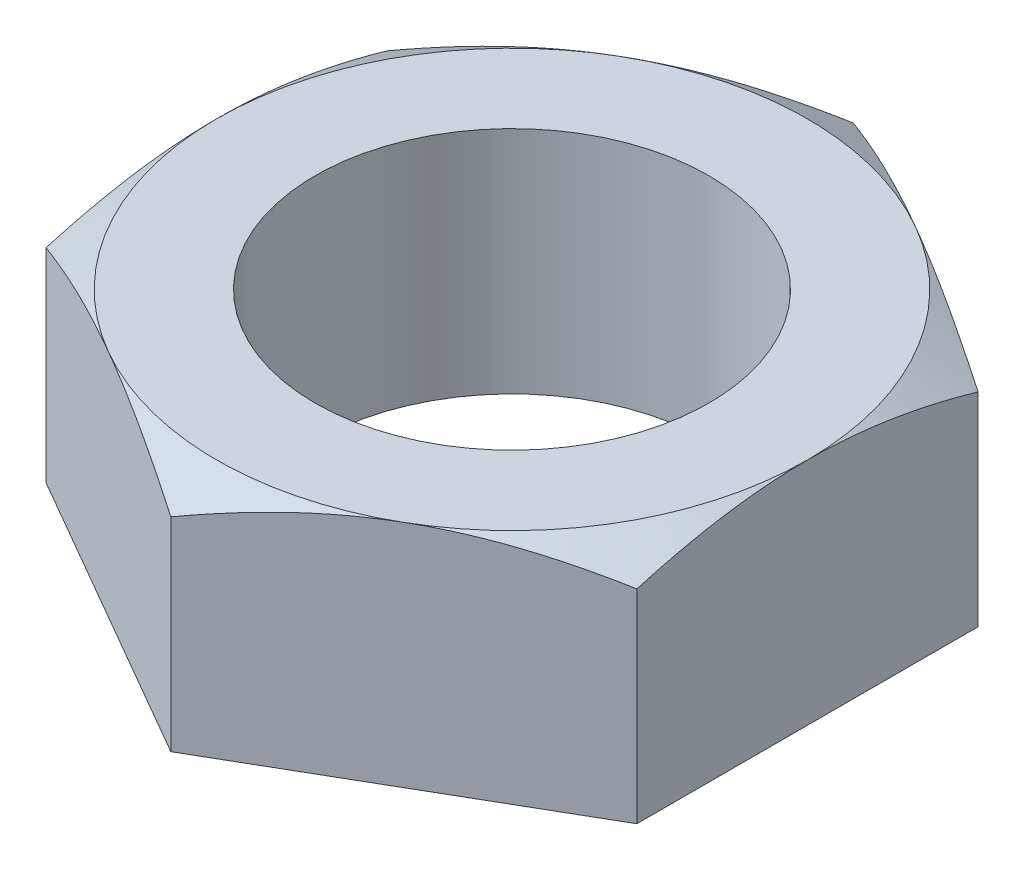
ISO-10303-21;
HEADER;
FILE_DESCRIPTION(('STEP AP214'),'2;1');
FILE_NAME('part.step','',(''),(''),'','','');
FILE_SCHEMA(('AUTOMOTIVE_DESIGN { 1 0 10303 214 1 1 1 1 }'));
ENDSEC;
DATA;
#1=APPLICATION_CONTEXT('core data for automotive mechanical design processes');
#2=APPLICATION_PROTOCOL_DEFINITION('international standard','automotive_design',2000,#1);
#3=PRODUCT_CONTEXT('',#1,'mechanical');
#4=PRODUCT('Part','Part','',(#3));
#5=PRODUCT_RELATED_PRODUCT_CATEGORY('part','',(#4));
#6=PRODUCT_DEFINITION_FORMATION('','',#4);
#7=PRODUCT_DEFINITION_CONTEXT('part definition',#1,'design');
#8=PRODUCT_DEFINITION('design','',#6,#7);
#9=PRODUCT_DEFINITION_SHAPE('','',#8);
#10=(LENGTH_UNIT() NAMED_UNIT(*) SI_UNIT(.MILLI.,.METRE.));
#11=(NAMED_UNIT(*) PLANE_ANGLE_UNIT() SI_UNIT($,.RADIAN.));
#12=(NAMED_UNIT(*) SI_UNIT($,.STERADIAN.) SOLID_ANGLE_UNIT());
#13=UNCERTAINTY_MEASURE_WITH_UNIT(LENGTH_MEASURE(1.E-05),#10,'distance_accuracy_value','');
#14=(GEOMETRIC_REPRESENTATION_CONTEXT(3) GLOBAL_UNCERTAINTY_ASSIGNED_CONTEXT((#13)) GLOBAL_UNIT_ASSIGNED_CONTEXT((#10,
#11,#12)) REPRESENTATION_CONTEXT('',''));
#15=CARTESIAN_POINT('',(0.,0.,0.));
#16=DIRECTION('',(0.,0.,1.));
#17=DIRECTION('',(1.,0.,0.));
#18=AXIS2_PLACEMENT_3D('',#15,#16,#17);
#19=CARTESIAN_POINT('',(-7.14375,2.778125,-4.12444598552339));
#20=DIRECTION('',(0.,1.,0.));
#21=DIRECTION('',(0.,0.,1.));
#22=AXIS2_PLACEMENT_3D('',#19,#20,#21);
#23=PLANE('',#22);
#24=CARTESIAN_POINT('',(0.,2.778125,0.));
#25=DIRECTION('',(0.,1.,0.));
#26=DIRECTION('',(0.,0.,1.));
#27=AXIS2_PLACEMENT_3D('',#24,#25,#26);
#28=CIRCLE('',#27,4.7625);
#29=CARTESIAN_POINT('',(0.,2.778125,4.7625));
#30=VERTEX_POINT('',#29);
#31=EDGE_CURVE('E195',#30,#30,#28,.T.);
#32=ORIENTED_EDGE('',*,*,#31,.F.);
#33=EDGE_LOOP('',(#32));
#34=FACE_BOUND('',#33,.T.);
#35=CARTESIAN_POINT('',(0.,2.778125,0.));
#36=DIRECTION('',(0.,1.,0.));
#37=DIRECTION('',(0.,0.,1.));
#38=AXIS2_PLACEMENT_3D('',#35,#36,#37);
#39=CIRCLE('',#38,7.14375);
#40=CARTESIAN_POINT('',(-3.571875,2.778125,6.18666897828509));
#41=VERTEX_POINT('',#40);
#42=CARTESIAN_POINT('',(3.571875,2.778125,6.18666897828508));
#43=VERTEX_POINT('',#42);
#44=EDGE_CURVE('E65',#41,#43,#39,.T.);
#45=ORIENTED_EDGE('',*,*,#44,.T.);
#46=CARTESIAN_POINT('',(7.14375,2.778125,0.));
#47=VERTEX_POINT('',#46);
#48=EDGE_CURVE('E140',#43,#47,#39,.T.);
#49=ORIENTED_EDGE('',*,*,#48,.T.);
#50=CARTESIAN_POINT('',(3.571875,2.778125,-6.18666897828509));
#51=VERTEX_POINT('',#50);
#52=EDGE_CURVE('E139',#47,#51,#39,.T.);
#53=ORIENTED_EDGE('',*,*,#52,.T.);
#54=CARTESIAN_POINT('',(-3.571875,2.778125,-6.18666897828508));
#55=VERTEX_POINT('',#54);
#56=EDGE_CURVE('E122',#51,#55,#39,.T.);
#57=ORIENTED_EDGE('',*,*,#56,.T.);
#58=CARTESIAN_POINT('',(-7.14375,2.778125,0.));
#59=VERTEX_POINT('',#58);
#60=EDGE_CURVE('E112',#55,#59,#39,.T.);
#61=ORIENTED_EDGE('',*,*,#60,.T.);
#62=EDGE_CURVE('E57',#59,#41,#39,.T.);
#63=ORIENTED_EDGE('',*,*,#62,.T.);
#64=EDGE_LOOP('',(#45,#49,#53,#57,#61,#63));
#65=FACE_BOUND('',#64,.T.);
#66=ADVANCED_FACE('F35',(#34,#65),#23,.T.);
#67=CARTESIAN_POINT('',(0.,2.778125,-8.24889197104678));
#68=DIRECTION('',(0.5,0.,0.866025403784439));
#69=DIRECTION('',(0.866025403784439,0.,-0.5));
#70=AXIS2_PLACEMENT_3D('',#67,#68,#69);
#71=PLANE('',#70);
#72=CARTESIAN_POINT('',(0.000200000000000107,2.14000431745692,-8.24900744110062));
#73=CARTESIAN_POINT('',(-0.156827656010892,2.19233896854997,-8.15834748163251));
#74=CARTESIAN_POINT('',(-0.314440787034965,2.24229847414077,-8.06734949800795));
#75=CARTESIAN_POINT('',(-0.630947036176424,2.3368130324684,-7.88461452986593));
#76=CARTESIAN_POINT('',(-0.789840675178982,2.38136575379793,-7.79287724461528));
#77=CARTESIAN_POINT('',(-1.26906566881349,2.50603923788883,-7.516196565538));
#78=CARTESIAN_POINT('',(-1.59128868458231,2.57695209004425,-7.33016102064478));
#79=CARTESIAN_POINT('',(-2.07348956329352,2.66010576140306,-7.05176221351739));
#80=CARTESIAN_POINT('',(-2.23202666824022,2.68379383444348,-6.96023077329986));
#81=CARTESIAN_POINT('',(-2.54981721974012,2.72351527686448,-6.77675431284548));
#82=CARTESIAN_POINT('',(-2.70907060174541,2.73954932257555,-6.68480932987537));
#83=CARTESIAN_POINT('',(-3.02785395116308,2.76355407799101,-6.50075967727591));
#84=CARTESIAN_POINT('',(-3.18738339793303,2.77153393858629,-6.4086553082396));
#85=CARTESIAN_POINT('',(-3.50658084468117,2.77926777570775,-6.22436657643492));
#86=CARTESIAN_POINT('',(-3.66624884022663,2.77902200635726,-6.13218221622578));
#87=CARTESIAN_POINT('',(-4.10368576449041,2.76704208960882,-5.87962789024861));
#88=CARTESIAN_POINT('',(-4.38131149667058,2.74693137885496,-5.71934059904042));
#89=CARTESIAN_POINT('',(-4.93471899661383,2.683160493257,-5.39983062997663));
#90=CARTESIAN_POINT('',(-5.21049881817465,2.63947852253424,-5.24060907576142));
#91=CARTESIAN_POINT('',(-5.76502002181279,2.53028640954325,-4.92045610956958));
#92=CARTESIAN_POINT('',(-6.04369143484908,2.46431363811182,-4.75956509423763));
#93=CARTESIAN_POINT('',(-6.59687851664504,2.31458211784186,-4.4401823836505));
#94=CARTESIAN_POINT('',(-6.87140126973619,2.23085853962436,-4.28168659825466));
#95=CARTESIAN_POINT('',(-7.14395,2.14000431745692,-4.12433051546955));
#96=B_SPLINE_CURVE_WITH_KNOTS('',3,(#72,#73,#74,#75,#76,#77,#78,#79,#80,#81,#82,#83,#84,#85,#86,
#87,#88,#89,#90,#91,#92,#93,#94,#95),.UNSPECIFIED.,.F.,.F.,(4,2,2,2,2,2,2,2,2,2,2,4),(0.,
0.566119481838006,1.13248221371019,2.2675610579816,2.82119915823018,3.37478832846408,
3.92774781910558,4.48069022658465,5.44329448766885,6.4067903790172,7.39165514483023,
8.37458648302854),.UNSPECIFIED.);
#97=CARTESIAN_POINT('',(0.,2.14007098552339,-8.24889197104678));
#98=VERTEX_POINT('',#97);
#99=EDGE_CURVE('E127',#98,#55,#96,.T.);
#100=ORIENTED_EDGE('',*,*,#99,.F.);
#101=DIRECTION('',(0.,-1.,0.));
#102=VECTOR('',#101,1.);
#103=CARTESIAN_POINT('',(0.,2.778125,-8.24889197104678));
#104=LINE('',#103,#102);
#105=CARTESIAN_POINT('',(0.,-2.778125,-8.24889197104678));
#106=VERTEX_POINT('',#105);
#107=EDGE_CURVE('E217',#98,#106,#104,.T.);
#108=ORIENTED_EDGE('',*,*,#107,.T.);
#109=DIRECTION('',(-0.866025403784439,0.,0.5));
#110=VECTOR('',#109,1.);
#111=CARTESIAN_POINT('',(0.,-2.778125,-8.24889197104678));
#112=LINE('',#111,#110);
#113=CARTESIAN_POINT('',(-7.14375,-2.778125,-4.12444598552339));
#114=VERTEX_POINT('',#113);
#115=EDGE_CURVE('E198',#106,#114,#112,.T.);
#116=ORIENTED_EDGE('',*,*,#115,.T.);
#117=DIRECTION('',(0.,-1.,0.));
#118=VECTOR('',#117,1.);
#119=CARTESIAN_POINT('',(-7.14375,2.778125,-4.12444598552339));
#120=LINE('',#119,#118);
#121=CARTESIAN_POINT('',(-7.14375,2.14007098552364,-4.12444598552376));
#122=VERTEX_POINT('',#121);
#123=EDGE_CURVE('E136',#122,#114,#120,.T.);
#124=ORIENTED_EDGE('',*,*,#123,.F.);
#125=EDGE_CURVE('E116',#55,#122,#96,.T.);
#126=ORIENTED_EDGE('',*,*,#125,.F.);
#127=EDGE_LOOP('',(#100,#108,#116,#124,#126));
#128=FACE_BOUND('',#127,.T.);
#129=ADVANCED_FACE('F37',(#128),#71,.F.);
#130=CARTESIAN_POINT('',(-7.14375,2.778125,-4.12444598552339));
#131=DIRECTION('',(1.,0.,0.));
#132=DIRECTION('',(0.,0.,-1.));
#133=AXIS2_PLACEMENT_3D('',#130,#131,#132);
#134=PLANE('',#133);
#135=CARTESIAN_POINT('',(-7.14375,-0.783886483872172,-11.2343990148108));
#136=CARTESIAN_POINT('',(-7.14375,-0.6312434051144,-10.921005816189));
#137=CARTESIAN_POINT('',(-7.14375,-0.480019727942791,-10.6069096305068));
#138=CARTESIAN_POINT('',(-7.14375,-0.181206610719341,-9.97693792380287));
#139=CARTESIAN_POINT('',(-7.14375,-0.0336177146506028,-9.66106214503462));
#140=CARTESIAN_POINT('',(-7.14375,0.257839749502272,-9.02560429625261));
#141=CARTESIAN_POINT('',(-7.14375,0.401685002081792,-8.70601149649409));
#142=CARTESIAN_POINT('',(-7.14375,0.683692033284538,-8.06433745060819));
#143=CARTESIAN_POINT('',(-7.14375,0.821854070575187,-7.74225631852977));
#144=CARTESIAN_POINT('',(-7.14375,1.09553030079379,-7.08419792229426));
#145=CARTESIAN_POINT('',(-7.14375,1.2307987290296,-6.74811789684533));
#146=CARTESIAN_POINT('',(-7.14375,1.49146974269251,-6.07208486148718));
#147=CARTESIAN_POINT('',(-7.14375,1.61687124330615,-5.73213143040941));
#148=CARTESIAN_POINT('',(-7.14375,1.85463021471785,-5.04839373385603));
#149=CARTESIAN_POINT('',(-7.14375,1.96701278005541,-4.70461828688789));
#150=CARTESIAN_POINT('',(-7.14375,2.17523247536187,-4.01215075758627));
#151=CARTESIAN_POINT('',(-7.14375,2.27107465304509,-3.66346021048113));
#152=CARTESIAN_POINT('',(-7.14375,2.44120580129563,-2.96283147330629));
#153=CARTESIAN_POINT('',(-7.14375,2.51561476512285,-2.61092321344154));
#154=CARTESIAN_POINT('',(-7.14375,2.60800425633336,-2.07973534613806));
#155=CARTESIAN_POINT('',(-7.14375,2.63559795003894,-1.9021066199372));
#156=CARTESIAN_POINT('',(-7.14375,2.68384014713947,-1.54591519838912));
#157=CARTESIAN_POINT('',(-7.14375,2.70448935817931,-1.36735260008805));
#158=CARTESIAN_POINT('',(-7.14375,2.73816396871097,-1.01193266860396));
#159=CARTESIAN_POINT('',(-7.14375,2.75128827376186,-0.835084746239089));
#160=CARTESIAN_POINT('',(-7.14375,2.77003988525338,-0.480991834877708));
#161=CARTESIAN_POINT('',(-7.14375,2.77566732067894,-0.303746852765236));
#162=CARTESIAN_POINT('',(-7.14375,2.7792902817917,0.0508237488135733));
#163=CARTESIAN_POINT('',(-7.14375,2.77728576167473,0.228149368757482));
#164=CARTESIAN_POINT('',(-7.14375,2.7656955286078,0.582554705448624));
#165=CARTESIAN_POINT('',(-7.14375,2.75610946615786,0.759634410482475));
#166=CARTESIAN_POINT('',(-7.14375,2.7245224177802,1.18051004971896));
#167=CARTESIAN_POINT('',(-7.14375,2.69918599076038,1.4240613670182));
#168=CARTESIAN_POINT('',(-7.14375,2.63551856661219,1.90944635109857));
#169=CARTESIAN_POINT('',(-7.14375,2.59718593627879,2.15127979809706));
#170=CARTESIAN_POINT('',(-7.14375,2.46471906723629,2.87386939525406));
#171=CARTESIAN_POINT('',(-7.14375,2.35313637488944,3.35147423738513));
#172=CARTESIAN_POINT('',(-7.14375,2.1584569616769,4.06598625677602));
#173=CARTESIAN_POINT('',(-7.14375,2.0880498145156,4.30656475639877));
#174=CARTESIAN_POINT('',(-7.14375,1.93963076650263,4.78538758900568));
#175=CARTESIAN_POINT('',(-7.14375,1.86161880746928,5.02363190411649));
#176=CARTESIAN_POINT('',(-7.14375,1.69926600712495,5.49785838027732));
#177=CARTESIAN_POINT('',(-7.14375,1.61492697153908,5.7338411652408));
#178=CARTESIAN_POINT('',(-7.14375,1.44094154194647,6.20382960223959));
#179=CARTESIAN_POINT('',(-7.14375,1.35129526673987,6.43783529839723));
#180=CARTESIAN_POINT('',(-7.14375,1.10435837396158,7.06453245177058));
#181=CARTESIAN_POINT('',(-7.14375,0.942970990996829,7.45560809244431));
#182=CARTESIAN_POINT('',(-7.14375,0.610791383046216,8.23375932046143));
#183=CARTESIAN_POINT('',(-7.14375,0.439998137107261,8.6208344681368));
#184=CARTESIAN_POINT('',(-7.14375,0.0912204241714318,9.39189635761781));
#185=CARTESIAN_POINT('',(-7.14375,-0.086766731305295,9.77588187928329));
#186=CARTESIAN_POINT('',(-7.14375,-0.448221384723887,10.5412374169402));
#187=CARTESIAN_POINT('',(-7.14375,-0.631688664505542,10.922607536308));
#188=CARTESIAN_POINT('',(-7.14375,-1.00321070586891,11.6838511345958));
#189=CARTESIAN_POINT('',(-7.14375,-1.19127227992618,12.0637212817482));
#190=CARTESIAN_POINT('',(-7.14375,-1.57081580886273,12.8217499678849));
#191=CARTESIAN_POINT('',(-7.14375,-1.76229779154882,13.1999084929229));
#192=CARTESIAN_POINT('',(-7.14375,-2.14797133524543,13.9547359506562));
#193=CARTESIAN_POINT('',(-7.14375,-2.34216229814946,14.3314051893134));
#194=CARTESIAN_POINT('',(-7.14375,-2.73279010228769,15.0835779685612));
#195=CARTESIAN_POINT('',(-7.14375,-2.92922695252572,15.4590815044708));
#196=CARTESIAN_POINT('',(-7.14375,-3.47986748966847,16.5054071004129));
#197=CARTESIAN_POINT('',(-7.14375,-3.83610128143336,17.1751605701008));
#198=CARTESIAN_POINT('',(-7.14375,-4.55286588563265,18.5124112865536));
#199=CARTESIAN_POINT('',(-7.14375,-4.91339695720857,19.1799083941043));
#200=CARTESIAN_POINT('',(-7.14375,-5.63645331883053,20.5109505646792));
#201=CARTESIAN_POINT('',(-7.14375,-5.9989680105417,21.1745013906757));
#202=CARTESIAN_POINT('',(-7.14375,-6.72644772702004,22.5001917500638));
#203=CARTESIAN_POINT('',(-7.14375,-7.09141255861521,23.162331389416));
#204=CARTESIAN_POINT('',(-7.14375,-7.45726816639072,23.8239748435067));
#205=B_SPLINE_CURVE_WITH_KNOTS('',3,(#135,#136,#137,#138,#139,#140,#141,#142,#143,#144,#145,
#146,#147,#148,#149,#150,#151,#152,#153,#154,#155,#156,#157,#158,#159,#160,#161,#162,#163,#164,
#165,#166,#167,#168,#169,#170,#171,#172,#173,#174,#175,#176,#177,#178,#179,#180,#181,#182,#183,
#184,#185,#186,#187,#188,#189,#190,#191,#192,#193,#194,#195,#196,#197,#198,#199,#200,#201,#202,
#203,#204),.UNSPECIFIED.,.F.,.F.,(4,2,2,2,2,2,2,2,2,2,2,2,2,2,2,2,2,2,2,2,2,2,2,2,2,2,2,2,2,2,2,
2,2,2,4),(0.,1.04578297895333,2.09172153070827,3.14309478196431,4.19442012766147,
5.28114199391359,6.36798317268592,7.4526932783328,8.53707176985381,9.61525584734915,
10.154419206224,10.6935276075299,11.2253773133639,11.7572178685137,12.2890616155782,
12.820929881428,13.5551153648123,14.289393145934,15.7586697455657,16.5106109823601,
17.2625579724378,18.0142911700117,18.7660075467392,20.0350264131132,21.304183296826,
22.5738189517484,23.843404130481,25.1150023078568,26.3866108276269,27.6579429023461,
28.9292800756562,31.205052403034,33.4809626691178,35.7493150399489,38.0174906236448),.UNSPECIFIED.);
#206=EDGE_CURVE('E118',#122,#59,#205,.T.);
#207=ORIENTED_EDGE('',*,*,#206,.F.);
#208=ORIENTED_EDGE('',*,*,#123,.T.);
#209=DIRECTION('',(0.,0.,1.));
#210=VECTOR('',#209,1.);
#211=CARTESIAN_POINT('',(-7.14375,-2.778125,-4.12444598552339));
#212=LINE('',#211,#210);
#213=CARTESIAN_POINT('',(-7.14375,-2.778125,4.12444598552339));
#214=VERTEX_POINT('',#213);
#215=EDGE_CURVE('E202',#114,#214,#212,.T.);
#216=ORIENTED_EDGE('',*,*,#215,.T.);
#217=DIRECTION('',(0.,-1.,0.));
#218=VECTOR('',#217,1.);
#219=CARTESIAN_POINT('',(-7.14375,2.778125,4.12444598552339));
#220=LINE('',#219,#218);
#221=CARTESIAN_POINT('',(-7.14375,2.14007098552339,4.12444598552339));
#222=VERTEX_POINT('',#221);
#223=EDGE_CURVE('E225',#222,#214,#220,.T.);
#224=ORIENTED_EDGE('',*,*,#223,.F.);
#225=EDGE_CURVE('E185',#59,#222,#205,.T.);
#226=ORIENTED_EDGE('',*,*,#225,.F.);
#227=EDGE_LOOP('',(#207,#208,#216,#224,#226));
#228=FACE_BOUND('',#227,.T.);
#229=ADVANCED_FACE('F174',(#228),#134,.F.);
#230=CARTESIAN_POINT('',(-7.14375,2.778125,4.12444598552339));
#231=DIRECTION('',(0.5,0.,-0.866025403784439));
#232=DIRECTION('',(-0.866025403784439,0.,-0.5));
#233=AXIS2_PLACEMENT_3D('',#230,#231,#232);
#234=PLANE('',#233);
#235=CARTESIAN_POINT('',(-7.14395,2.14000431745692,4.12433051546955));
#236=CARTESIAN_POINT('',(-6.98692234398911,2.19233896854997,4.21499047493766));
#237=CARTESIAN_POINT('',(-6.82930921296504,2.24229847414077,4.30598845856222));
#238=CARTESIAN_POINT('',(-6.51280296382358,2.3368130324684,4.48872342670424));
#239=CARTESIAN_POINT('',(-6.35390932482102,2.38136575379793,4.58046071195489));
#240=CARTESIAN_POINT('',(-5.87468433118651,2.50603923788883,4.85714139103217));
#241=CARTESIAN_POINT('',(-5.55246131541769,2.57695209004425,5.04317693592539));
#242=CARTESIAN_POINT('',(-5.07026043670648,2.66010576140306,5.32157574305278));
#243=CARTESIAN_POINT('',(-4.91172333175978,2.68379383444348,5.4131071832703));
#244=CARTESIAN_POINT('',(-4.59393278025988,2.72351527686448,5.59658364372469));
#245=CARTESIAN_POINT('',(-4.4346793982546,2.73954932257555,5.6885286266948));
#246=CARTESIAN_POINT('',(-4.11589604883692,2.76355407799101,5.87257827929426));
#247=CARTESIAN_POINT('',(-3.95636660206697,2.77153393858629,5.96468264833057));
#248=CARTESIAN_POINT('',(-3.63716915531883,2.77926777570775,6.14897138013525));
#249=CARTESIAN_POINT('',(-3.47750115977338,2.77902200635726,6.24115574034438));
#250=CARTESIAN_POINT('',(-3.04006423550959,2.76704208960882,6.49371006632156));
#251=CARTESIAN_POINT('',(-2.76243850332943,2.74693137885496,6.65399735752975));
#252=CARTESIAN_POINT('',(-2.20903100338617,2.683160493257,6.97350732659354));
#253=CARTESIAN_POINT('',(-1.93325118182535,2.63947852253424,7.13272888080875));
#254=CARTESIAN_POINT('',(-1.37872997818721,2.53028640954325,7.45288184700058));
#255=CARTESIAN_POINT('',(-1.10005856515092,2.46431363811182,7.61377286233254));
#256=CARTESIAN_POINT('',(-0.546871483354959,2.31458211784186,7.93315557291966));
#257=CARTESIAN_POINT('',(-0.272348730263814,2.23085853962436,8.09165135831551));
#258=CARTESIAN_POINT('',(0.000199999999998521,2.14000431745692,8.24900744110061));
#259=B_SPLINE_CURVE_WITH_KNOTS('',3,(#235,#236,#237,#238,#239,#240,#241,#242,#243,#244,#245,
#246,#247,#248,#249,#250,#251,#252,#253,#254,#255,#256,#257,#258),.UNSPECIFIED.,.F.,.F.,(4,2,2,
2,2,2,2,2,2,2,2,4),(0.,0.566119481838005,1.13248221371019,2.2675610579816,2.82119915823017,
3.37478832846408,3.92774781910558,4.48069022658465,5.44329448766884,6.4067903790172,
7.39165514483023,8.37458648302853),.UNSPECIFIED.);
#260=EDGE_CURVE('E183',#222,#41,#259,.T.);
#261=ORIENTED_EDGE('',*,*,#260,.F.);
#262=ORIENTED_EDGE('',*,*,#223,.T.);
#263=DIRECTION('',(0.866025403784439,0.,0.5));
#264=VECTOR('',#263,1.);
#265=CARTESIAN_POINT('',(-7.14375,-2.778125,4.12444598552339));
#266=LINE('',#265,#264);
#267=CARTESIAN_POINT('',(0.,-2.778125,8.24889197104678));
#268=VERTEX_POINT('',#267);
#269=EDGE_CURVE('E205',#214,#268,#266,.T.);
#270=ORIENTED_EDGE('',*,*,#269,.T.);
#271=DIRECTION('',(0.,-1.,0.));
#272=VECTOR('',#271,1.);
#273=CARTESIAN_POINT('',(0.,2.778125,8.24889197104678));
#274=LINE('',#273,#272);
#275=CARTESIAN_POINT('',(0.,2.14007098552339,8.24889197104678));
#276=VERTEX_POINT('',#275);
#277=EDGE_CURVE('E223',#276,#268,#274,.T.);
#278=ORIENTED_EDGE('',*,*,#277,.F.);
#279=EDGE_CURVE('E177',#41,#276,#259,.T.);
#280=ORIENTED_EDGE('',*,*,#279,.F.);
#281=EDGE_LOOP('',(#261,#262,#270,#278,#280));
#282=FACE_BOUND('',#281,.T.);
#283=ADVANCED_FACE('F170',(#282),#234,.F.);
#284=CARTESIAN_POINT('',(0.,2.778125,8.24889197104678));
#285=DIRECTION('',(-0.5,0.,-0.866025403784438));
#286=DIRECTION('',(-0.866025403784439,0.,0.5));
#287=AXIS2_PLACEMENT_3D('',#284,#285,#286);
#288=PLANE('',#287);
#289=CARTESIAN_POINT('',(-0.000200000000002163,2.14000431745692,8.24900744110061));
#290=CARTESIAN_POINT('',(0.15682765601089,2.19233896854997,8.15834748163251));
#291=CARTESIAN_POINT('',(0.314440787034963,2.24229847414077,8.06734949800794));
#292=CARTESIAN_POINT('',(0.630947036176422,2.3368130324684,7.88461452986592));
#293=CARTESIAN_POINT('',(0.78984067517898,2.38136575379793,7.79287724461528));
#294=CARTESIAN_POINT('',(1.26906566881349,2.50603923788883,7.51619656553799));
#295=CARTESIAN_POINT('',(1.59128868458231,2.57695209004425,7.33016102064478));
#296=CARTESIAN_POINT('',(2.07348956329352,2.66010576140306,7.05176221351738));
#297=CARTESIAN_POINT('',(2.23202666824022,2.68379383444349,6.96023077329986));
#298=CARTESIAN_POINT('',(2.54981721974011,2.72351527686449,6.77675431284548));
#299=CARTESIAN_POINT('',(2.7090706017454,2.73954932257555,6.68480932987537));
#300=CARTESIAN_POINT('',(3.02785395116307,2.76355407799102,6.5007596772759));
#301=CARTESIAN_POINT('',(3.18738339793303,2.77153393858629,6.4086553082396));
#302=CARTESIAN_POINT('',(3.50658084468117,2.77926777570776,6.22436657643492));
#303=CARTESIAN_POINT('',(3.66624884022662,2.77902200635726,6.13218221622578));
#304=CARTESIAN_POINT('',(4.1036857644904,2.76704208960882,5.8796278902486));
#305=CARTESIAN_POINT('',(4.38131149667057,2.74693137885496,5.71934059904042));
#306=CARTESIAN_POINT('',(4.93471899661383,2.683160493257,5.39983062997662));
#307=CARTESIAN_POINT('',(5.21049881817465,2.63947852253424,5.24060907576141));
#308=CARTESIAN_POINT('',(5.76502002181279,2.53028640954326,4.92045610956958));
#309=CARTESIAN_POINT('',(6.04369143484908,2.46431363811182,4.75956509423762));
#310=CARTESIAN_POINT('',(6.59687851664504,2.31458211784187,4.4401823836505));
#311=CARTESIAN_POINT('',(6.87140126973619,2.23085853962436,4.28168659825465));
#312=CARTESIAN_POINT('',(7.14395,2.14000431745692,4.12433051546955));
#313=B_SPLINE_CURVE_WITH_KNOTS('',3,(#289,#290,#291,#292,#293,#294,#295,#296,#297,#298,#299,
#300,#301,#302,#303,#304,#305,#306,#307,#308,#309,#310,#311,#312),.UNSPECIFIED.,.F.,.F.,(4,2,2,
2,2,2,2,2,2,2,2,4),(0.,0.566119481838006,1.13248221371019,2.2675610579816,2.82119915823017,
3.37478832846408,3.92774781910558,4.48069022658465,5.44329448766885,6.4067903790172,
7.39165514483024,8.37458648302854),.UNSPECIFIED.);
#314=EDGE_CURVE('E184',#276,#43,#313,.T.);
#315=ORIENTED_EDGE('',*,*,#314,.F.);
#316=ORIENTED_EDGE('',*,*,#277,.T.);
#317=DIRECTION('',(0.866025403784439,0.,-0.5));
#318=VECTOR('',#317,1.);
#319=CARTESIAN_POINT('',(0.,-2.778125,8.24889197104678));
#320=LINE('',#319,#318);
#321=CARTESIAN_POINT('',(7.14375,-2.778125,4.12444598552339));
#322=VERTEX_POINT('',#321);
#323=EDGE_CURVE('E208',#268,#322,#320,.T.);
#324=ORIENTED_EDGE('',*,*,#323,.T.);
#325=DIRECTION('',(0.,-1.,0.));
#326=VECTOR('',#325,1.);
#327=CARTESIAN_POINT('',(7.14375,2.778125,4.12444598552339));
#328=LINE('',#327,#326);
#329=CARTESIAN_POINT('',(7.14375,2.14007098552339,4.12444598552339));
#330=VERTEX_POINT('',#329);
#331=EDGE_CURVE('E221',#330,#322,#328,.T.);
#332=ORIENTED_EDGE('',*,*,#331,.F.);
#333=EDGE_CURVE('E150',#43,#330,#313,.T.);
#334=ORIENTED_EDGE('',*,*,#333,.F.);
#335=EDGE_LOOP('',(#315,#316,#324,#332,#334));
#336=FACE_BOUND('',#335,.T.);
#337=ADVANCED_FACE('F163',(#336),#288,.F.);
#338=CARTESIAN_POINT('',(7.14375,2.778125,4.12444598552339));
#339=DIRECTION('',(-1.,0.,0.));
#340=DIRECTION('',(0.,0.,1.));
#341=AXIS2_PLACEMENT_3D('',#338,#339,#340);
#342=PLANE('',#341);
#343=CARTESIAN_POINT('',(7.14374999999999,-0.783886481129418,-11.2343990091811));
#344=CARTESIAN_POINT('',(7.14375,-0.631243402485976,-10.9210058107488));
#345=CARTESIAN_POINT('',(7.14375,-0.480019725428632,-10.6069096252563));
#346=CARTESIAN_POINT('',(7.14375,-0.181206608433159,-9.9769379189323));
#347=CARTESIAN_POINT('',(7.14375,-0.0336177124781325,-9.66106214035428));
#348=CARTESIAN_POINT('',(7.14375,0.257839751447258,-9.02560429195563));
#349=CARTESIAN_POINT('',(7.14375,0.401685003913025,-8.70601149239023));
#350=CARTESIAN_POINT('',(7.14375,0.683692034890141,-8.06433744689188));
#351=CARTESIAN_POINT('',(7.14375,0.821854072068915,-7.74225631500788));
#352=CARTESIAN_POINT('',(7.14375,1.09553030206039,-7.08419791917651));
#353=CARTESIAN_POINT('',(7.14375,1.23079873018122,-6.74811789393745));
#354=CARTESIAN_POINT('',(7.14375,1.49146974362025,-6.07208485900236));
#355=CARTESIAN_POINT('',(7.14375,1.616871244125,-5.7321314281378));
#356=CARTESIAN_POINT('',(7.14375,1.85463021532924,-5.0483937320148));
#357=CARTESIAN_POINT('',(7.14375,1.96701278056821,-4.70461828526381));
#358=CARTESIAN_POINT('',(7.14375,2.17523247569343,-4.01215075640233));
#359=CARTESIAN_POINT('',(7.14375,2.27107465329399,-3.66346020952019));
#360=CARTESIAN_POINT('',(7.14375,2.44120580137762,-2.96283147290508));
#361=CARTESIAN_POINT('',(7.14375,2.51561476512687,-2.61092321337863));
#362=CARTESIAN_POINT('',(7.14375,2.60800425625846,-2.07973534658863));
#363=CARTESIAN_POINT('',(7.14375,2.63559794994408,-1.90210662055988));
#364=CARTESIAN_POINT('',(7.14375,2.68384014701883,-1.54591519935749));
#365=CARTESIAN_POINT('',(7.14375,2.70448935805285,-1.36735260123001));
#366=CARTESIAN_POINT('',(7.14375,2.73816396858824,-1.0119326700895));
#367=CARTESIAN_POINT('',(7.14375,2.7512882736484,-0.835084747894604));
#368=CARTESIAN_POINT('',(7.14375,2.77003988517351,-0.480991836872878));
#369=CARTESIAN_POINT('',(7.14375,2.77566732062339,-0.303746854930088));
#370=CARTESIAN_POINT('',(7.14375,2.77929028179954,0.0508237463105959));
#371=CARTESIAN_POINT('',(7.14375,2.77728576172165,0.228149366086062));
#372=CARTESIAN_POINT('',(7.14375,2.76569552874658,0.582554702442491));
#373=CARTESIAN_POINT('',(7.14375,2.75610946634944,0.759634407310073));
#374=CARTESIAN_POINT('',(7.14375,2.72452241810158,1.18051004629132));
#375=CARTESIAN_POINT('',(7.14375,2.69918599115634,1.42406136350232));
#376=CARTESIAN_POINT('',(7.14375,2.6355185671613,1.90944634741024));
#377=CARTESIAN_POINT('',(7.14375,2.59718593690646,2.15127979432452));
#378=CARTESIAN_POINT('',(7.14375,2.46471906810124,2.87386939123355));
#379=CARTESIAN_POINT('',(7.14375,2.35313637591462,3.3514742332059));
#380=CARTESIAN_POINT('',(7.14375,2.15845696293844,4.06598625235938));
#381=CARTESIAN_POINT('',(7.14375,2.08804981585648,4.30656475190127));
#382=CARTESIAN_POINT('',(7.14375,1.9396307679997,4.7853875843474));
#383=CARTESIAN_POINT('',(7.14375,1.86161880904322,5.02363189937828));
#384=CARTESIAN_POINT('',(7.14375,1.69926600884982,5.49785837537985));
#385=CARTESIAN_POINT('',(7.14375,1.61492697333802,5.73384116026401));
#386=CARTESIAN_POINT('',(7.14375,1.44094154389093,6.20382959710414));
#387=CARTESIAN_POINT('',(7.14375,1.35129526875578,6.43783529318245));
#388=CARTESIAN_POINT('',(7.14375,1.1043583761,7.06453244651065));
#389=CARTESIAN_POINT('',(7.14375,0.942970993178663,7.45560808721625));
#390=CARTESIAN_POINT('',(7.14375,0.610791385302376,8.23375931529299));
#391=CARTESIAN_POINT('',(7.14375,0.439998139394321,8.62083446299612));
#392=CARTESIAN_POINT('',(7.14375,0.0912204265112013,9.3918963525297));
#393=CARTESIAN_POINT('',(7.14375,-0.086766728943727,9.77588187421998));
#394=CARTESIAN_POINT('',(7.14375,-0.448221382325148,10.5412374119239));
#395=CARTESIAN_POINT('',(7.14375,-0.631688662091428,10.9226075313137));
#396=CARTESIAN_POINT('',(7.14375,-1.00321070342941,11.6838511296451));
#397=CARTESIAN_POINT('',(7.14375,-1.19127227747669,12.063721276819));
#398=CARTESIAN_POINT('',(7.14375,-1.57081580639679,12.821749962997));
#399=CARTESIAN_POINT('',(7.14375,-1.76229778907644,13.1999084880548));
#400=CARTESIAN_POINT('',(7.14375,-2.14797133276271,13.9547359458263));
#401=CARTESIAN_POINT('',(7.14375,-2.34216229566284,14.3314051845019));
#402=CARTESIAN_POINT('',(7.14375,-2.73279009979533,15.0835779637854));
#403=CARTESIAN_POINT('',(7.14375,-2.92922695003151,15.4590814997124));
#404=CARTESIAN_POINT('',(7.14375,-3.479867487156,16.5054070956728));
#405=CARTESIAN_POINT('',(7.14375,-3.83610127890596,17.1751605653609));
#406=CARTESIAN_POINT('',(7.14375,-4.55286588307842,18.5124112818127));
#407=CARTESIAN_POINT('',(7.14375000000001,-4.91339695464244,19.1799083893621));
#408=CARTESIAN_POINT('',(7.14375000000001,-5.63645331624,20.5109505599287));
#409=CARTESIAN_POINT('',(7.14375000000001,-5.99896800793863,21.1745013859179));
#410=CARTESIAN_POINT('',(7.14375000000001,-6.72644772439325,22.5001917452907));
#411=CARTESIAN_POINT('',(7.14375000000001,-7.09141255597725,23.1623313846349));
#412=CARTESIAN_POINT('',(7.14375000000001,-7.45726816374203,23.8239748387172));
#413=B_SPLINE_CURVE_WITH_KNOTS('',3,(#343,#344,#345,#346,#347,#348,#349,#350,#351,#352,#353,
#354,#355,#356,#357,#358,#359,#360,#361,#362,#363,#364,#365,#366,#367,#368,#369,#370,#371,#372,
#373,#374,#375,#376,#377,#378,#379,#380,#381,#382,#383,#384,#385,#386,#387,#388,#389,#390,#391,
#392,#393,#394,#395,#396,#397,#398,#399,#400,#401,#402,#403,#404,#405,#406,#407,#408,#409,#410,
#411,#412),.UNSPECIFIED.,.F.,.F.,(4,2,2,2,2,2,2,2,2,2,2,2,2,2,2,2,2,2,2,2,2,2,2,2,2,2,2,2,2,2,2,
2,2,2,4),(0.,1.04578297829195,2.09172152938542,3.14309477997306,4.19442012500189,
5.28114199054123,6.36798316860054,7.4526932735367,8.53707176434755,9.6152558408041,
10.1544191991599,10.693527599947,11.225377305275,11.7572178599187,12.2890616064771,
12.8209298718206,13.5551153549187,14.2893931357541,15.7586697348118,16.5106109713065,
17.2625579610844,18.0142911583593,18.7660075347878,20.0350264012001,21.3041832849514,
22.5738189399137,23.843404118686,25.1150022961061,26.3866108159206,27.6579428906834,
28.9292800640371,31.2050523913944,33.480962657458,35.7493150282521,38.0174906119106),.UNSPECIFIED.);
#414=EDGE_CURVE('E149',#330,#47,#413,.F.);
#415=ORIENTED_EDGE('',*,*,#414,.F.);
#416=ORIENTED_EDGE('',*,*,#331,.T.);
#417=DIRECTION('',(0.,0.,-1.));
#418=VECTOR('',#417,1.);
#419=CARTESIAN_POINT('',(7.14375,-2.778125,4.12444598552339));
#420=LINE('',#419,#418);
#421=CARTESIAN_POINT('',(7.14375,-2.778125,-4.12444598552339));
#422=VERTEX_POINT('',#421);
#423=EDGE_CURVE('E211',#322,#422,#420,.T.);
#424=ORIENTED_EDGE('',*,*,#423,.T.);
#425=DIRECTION('',(0.,-1.,0.));
#426=VECTOR('',#425,1.);
#427=CARTESIAN_POINT('',(7.14375,2.778125,-4.12444598552339));
#428=LINE('',#427,#426);
#429=CARTESIAN_POINT('',(7.14375,2.14007098552339,-4.12444598552339));
#430=VERTEX_POINT('',#429);
#431=EDGE_CURVE('E219',#430,#422,#428,.T.);
#432=ORIENTED_EDGE('',*,*,#431,.F.);
#433=EDGE_CURVE('E142',#47,#430,#413,.F.);
#434=ORIENTED_EDGE('',*,*,#433,.F.);
#435=EDGE_LOOP('',(#415,#416,#424,#432,#434));
#436=FACE_BOUND('',#435,.T.);
#437=ADVANCED_FACE('F159',(#436),#342,.F.);
#438=CARTESIAN_POINT('',(7.14375,2.778125,-4.12444598552339));
#439=DIRECTION('',(-0.5,0.,0.866025403784439));
#440=DIRECTION('',(0.866025403784439,0.,0.5));
#441=AXIS2_PLACEMENT_3D('',#438,#439,#440);
#442=PLANE('',#441);
#443=CARTESIAN_POINT('',(7.14395,2.14000431745692,-4.12433051546955));
#444=CARTESIAN_POINT('',(6.9869223439891,2.19233896854997,-4.21499047493766));
#445=CARTESIAN_POINT('',(6.82930921296503,2.24229847414077,-4.30598845856223));
#446=CARTESIAN_POINT('',(6.51280296382357,2.3368130324684,-4.48872342670425));
#447=CARTESIAN_POINT('',(6.35390932482102,2.38136575379793,-4.58046071195489));
#448=CARTESIAN_POINT('',(5.87468433118651,2.50603923788883,-4.85714139103218));
#449=CARTESIAN_POINT('',(5.55246131541769,2.57695209004425,-5.04317693592539));
#450=CARTESIAN_POINT('',(5.07026043670648,2.66010576140306,-5.32157574305279));
#451=CARTESIAN_POINT('',(4.91172333175978,2.68379383444348,-5.41310718327031));
#452=CARTESIAN_POINT('',(4.59393278025988,2.72351527686448,-5.59658364372469));
#453=CARTESIAN_POINT('',(4.43467939825459,2.73954932257555,-5.6885286266948));
#454=CARTESIAN_POINT('',(4.11589604883692,2.76355407799101,-5.87257827929427));
#455=CARTESIAN_POINT('',(3.95636660206697,2.77153393858629,-5.96468264833057));
#456=CARTESIAN_POINT('',(3.63716915531883,2.77926777570775,-6.14897138013525));
#457=CARTESIAN_POINT('',(3.47750115977337,2.77902200635726,-6.24115574034439));
#458=CARTESIAN_POINT('',(3.04006423550959,2.76704208960882,-6.49371006632156));
#459=CARTESIAN_POINT('',(2.76243850332942,2.74693137885496,-6.65399735752975));
#460=CARTESIAN_POINT('',(2.20903100338617,2.683160493257,-6.97350732659355));
#461=CARTESIAN_POINT('',(1.93325118182535,2.63947852253424,-7.13272888080875));
#462=CARTESIAN_POINT('',(1.37872997818721,2.53028640954325,-7.45288184700059));
#463=CARTESIAN_POINT('',(1.10005856515092,2.46431363811182,-7.61377286233255));
#464=CARTESIAN_POINT('',(0.546871483354955,2.31458211784186,-7.93315557291967));
#465=CARTESIAN_POINT('',(0.272348730263811,2.23085853962436,-8.09165135831552));
#466=CARTESIAN_POINT('',(-0.000200000000000516,2.14000431745692,-8.24900744110062));
#467=B_SPLINE_CURVE_WITH_KNOTS('',3,(#443,#444,#445,#446,#447,#448,#449,#450,#451,#452,#453,
#454,#455,#456,#457,#458,#459,#460,#461,#462,#463,#464,#465,#466),.UNSPECIFIED.,.F.,.F.,(4,2,2,
2,2,2,2,2,2,2,2,4),(0.,0.566119481838005,1.13248221371019,2.2675610579816,2.82119915823017,
3.37478832846408,3.92774781910558,4.48069022658465,5.44329448766884,6.4067903790172,
7.39165514483023,8.37458648302853),.UNSPECIFIED.);
#468=EDGE_CURVE('E12',#430,#51,#467,.T.);
#469=ORIENTED_EDGE('',*,*,#468,.F.);
#470=ORIENTED_EDGE('',*,*,#431,.T.);
#471=DIRECTION('',(-0.866025403784439,0.,-0.5));
#472=VECTOR('',#471,1.);
#473=CARTESIAN_POINT('',(7.14375,-2.778125,-4.12444598552339));
#474=LINE('',#473,#472);
#475=EDGE_CURVE('E214',#422,#106,#474,.T.);
#476=ORIENTED_EDGE('',*,*,#475,.T.);
#477=ORIENTED_EDGE('',*,*,#107,.F.);
#478=EDGE_CURVE('E40',#51,#98,#467,.T.);
#479=ORIENTED_EDGE('',*,*,#478,.F.);
#480=EDGE_LOOP('',(#469,#470,#476,#477,#479));
#481=FACE_BOUND('',#480,.T.);
#482=ADVANCED_FACE('F162',(#481),#442,.F.);
#483=CARTESIAN_POINT('',(-7.14375,-2.778125,-4.12444598552339));
#484=DIRECTION('',(0.,1.,0.));
#485=DIRECTION('',(0.,0.,1.));
#486=AXIS2_PLACEMENT_3D('',#483,#484,#485);
#487=PLANE('',#486);
#488=ORIENTED_EDGE('',*,*,#115,.F.);
#489=ORIENTED_EDGE('',*,*,#475,.F.);
#490=ORIENTED_EDGE('',*,*,#423,.F.);
#491=ORIENTED_EDGE('',*,*,#323,.F.);
#492=ORIENTED_EDGE('',*,*,#269,.F.);
#493=ORIENTED_EDGE('',*,*,#215,.F.);
#494=EDGE_LOOP('',(#488,#489,#490,#491,#492,#493));
#495=FACE_BOUND('',#494,.T.);
#496=CARTESIAN_POINT('',(0.,-2.778125,0.));
#497=DIRECTION('',(0.,1.,0.));
#498=DIRECTION('',(0.,0.,1.));
#499=AXIS2_PLACEMENT_3D('',#496,#497,#498);
#500=CIRCLE('',#499,4.7625);
#501=CARTESIAN_POINT('',(0.,-2.778125,4.7625));
#502=VERTEX_POINT('',#501);
#503=EDGE_CURVE('E132',#502,#502,#500,.T.);
#504=ORIENTED_EDGE('',*,*,#503,.T.);
#505=EDGE_LOOP('',(#504));
#506=FACE_BOUND('',#505,.T.);
#507=ADVANCED_FACE('F232',(#495,#506),#487,.F.);
#508=CARTESIAN_POINT('',(0.,2.778125,0.));
#509=DIRECTION('',(0.,-1.,0.));
#510=DIRECTION('',(0.,0.,-1.));
#511=AXIS2_PLACEMENT_3D('',#508,#509,#510);
#512=CYLINDRICAL_SURFACE('',#511,4.7625);
#513=ORIENTED_EDGE('',*,*,#31,.T.);
#514=EDGE_LOOP('',(#513));
#515=FACE_BOUND('',#514,.T.);
#516=ORIENTED_EDGE('',*,*,#503,.F.);
#517=EDGE_LOOP('',(#516));
#518=FACE_BOUND('',#517,.T.);
#519=ADVANCED_FACE('F260',(#515,#518),#512,.F.);
#520=CARTESIAN_POINT('',(0.,2.778125,0.));
#521=DIRECTION('',(0.,-1.,0.));
#522=DIRECTION('',(0.,0.,1.));
#523=AXIS2_PLACEMENT_3D('',#520,#521,#522);
#524=CONICAL_SURFACE('',#523,7.14375,1.0471975511966);
#525=ORIENTED_EDGE('',*,*,#99,.T.);
#526=ORIENTED_EDGE('',*,*,#56,.F.);
#527=ORIENTED_EDGE('',*,*,#478,.T.);
#528=EDGE_LOOP('',(#525,#526,#527));
#529=FACE_BOUND('',#528,.T.);
#530=ADVANCED_FACE('F128',(#529),#524,.T.);
#531=ORIENTED_EDGE('',*,*,#433,.T.);
#532=ORIENTED_EDGE('',*,*,#468,.T.);
#533=ORIENTED_EDGE('',*,*,#52,.F.);
#534=EDGE_LOOP('',(#531,#532,#533));
#535=FACE_BOUND('',#534,.T.);
#536=ADVANCED_FACE('F253',(#535),#524,.T.);
#537=ORIENTED_EDGE('',*,*,#333,.T.);
#538=ORIENTED_EDGE('',*,*,#414,.T.);
#539=ORIENTED_EDGE('',*,*,#48,.F.);
#540=EDGE_LOOP('',(#537,#538,#539));
#541=FACE_BOUND('',#540,.T.);
#542=ADVANCED_FACE('F251',(#541),#524,.T.);
#543=ORIENTED_EDGE('',*,*,#279,.T.);
#544=ORIENTED_EDGE('',*,*,#314,.T.);
#545=ORIENTED_EDGE('',*,*,#44,.F.);
#546=EDGE_LOOP('',(#543,#544,#545));
#547=FACE_BOUND('',#546,.T.);
#548=ADVANCED_FACE('F259',(#547),#524,.T.);
#549=ORIENTED_EDGE('',*,*,#225,.T.);
#550=ORIENTED_EDGE('',*,*,#260,.T.);
#551=ORIENTED_EDGE('',*,*,#62,.F.);
#552=EDGE_LOOP('',(#549,#550,#551));
#553=FACE_BOUND('',#552,.T.);
#554=ADVANCED_FACE('F248',(#553),#524,.T.);
#555=ORIENTED_EDGE('',*,*,#125,.T.);
#556=ORIENTED_EDGE('',*,*,#206,.T.);
#557=ORIENTED_EDGE('',*,*,#60,.F.);
#558=EDGE_LOOP('',(#555,#556,#557));
#559=FACE_BOUND('',#558,.T.);
#560=ADVANCED_FACE('F114',(#559),#524,.T.);
#561=CLOSED_SHELL('',(#66,#129,#229,#283,#337,#437,#482,#507,#519,#530,#536,#542,#548,#554,#560));
#562=MANIFOLD_SOLID_BREP('B2',#561);
#563=ADVANCED_BREP_SHAPE_REPRESENTATION('',(#18,#562),#14);
#564=SHAPE_DEFINITION_REPRESENTATION(#9,#563);
ENDSEC;
END-ISO-10303-21;
